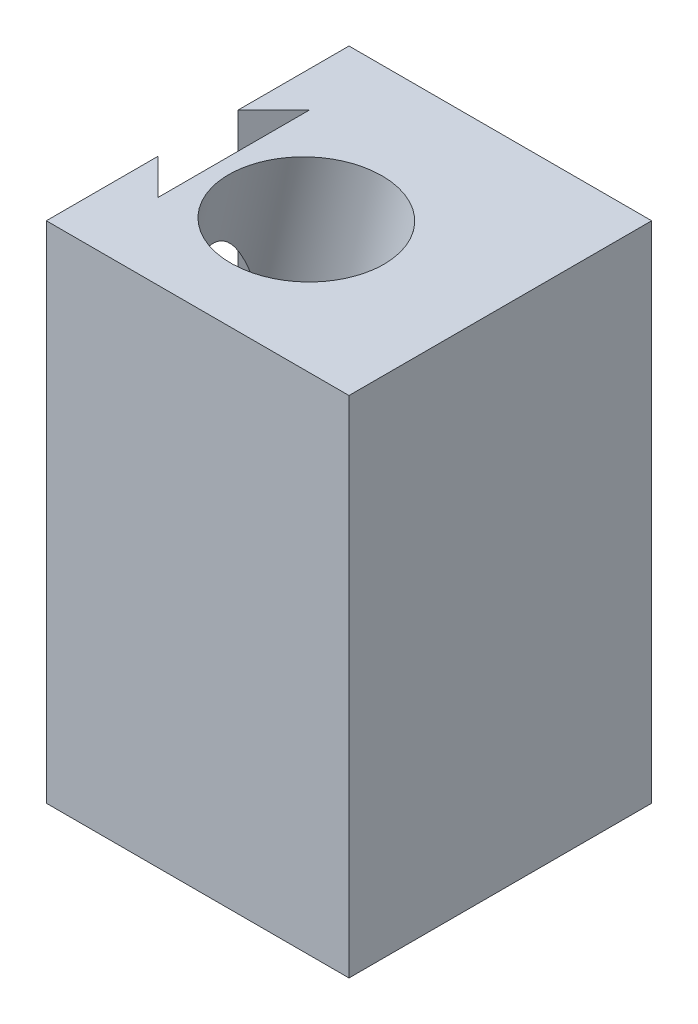
ISO-10303-21;
HEADER;
FILE_DESCRIPTION(('STEP AP214'),'2;1');
FILE_NAME('part.step','',(''),(''),'','','');
FILE_SCHEMA(('AUTOMOTIVE_DESIGN { 1 0 10303 214 1 1 1 1 }'));
ENDSEC;
DATA;
#1=APPLICATION_CONTEXT('core data for automotive mechanical design processes');
#2=APPLICATION_PROTOCOL_DEFINITION('international standard','automotive_design',2000,#1);
#3=PRODUCT_CONTEXT('',#1,'mechanical');
#4=PRODUCT('Part','Part','',(#3));
#5=PRODUCT_RELATED_PRODUCT_CATEGORY('part','',(#4));
#6=PRODUCT_DEFINITION_FORMATION('','',#4);
#7=PRODUCT_DEFINITION_CONTEXT('part definition',#1,'design');
#8=PRODUCT_DEFINITION('design','',#6,#7);
#9=PRODUCT_DEFINITION_SHAPE('','',#8);
#10=(LENGTH_UNIT() NAMED_UNIT(*) SI_UNIT(.MILLI.,.METRE.));
#11=(NAMED_UNIT(*) PLANE_ANGLE_UNIT() SI_UNIT($,.RADIAN.));
#12=(NAMED_UNIT(*) SI_UNIT($,.STERADIAN.) SOLID_ANGLE_UNIT());
#13=UNCERTAINTY_MEASURE_WITH_UNIT(LENGTH_MEASURE(1.E-05),#10,'distance_accuracy_value','');
#14=(GEOMETRIC_REPRESENTATION_CONTEXT(3) GLOBAL_UNCERTAINTY_ASSIGNED_CONTEXT((#13)) GLOBAL_UNIT_ASSIGNED_CONTEXT((#10,
#11,#12)) REPRESENTATION_CONTEXT('',''));
#15=CARTESIAN_POINT('',(0.,0.,0.));
#16=DIRECTION('',(0.,0.,1.));
#17=DIRECTION('',(1.,0.,0.));
#18=AXIS2_PLACEMENT_3D('',#15,#16,#17);
#19=CARTESIAN_POINT('',(3.53553390593274,50.,-22.5355339059327));
#20=DIRECTION('',(1.,0.,0.));
#21=DIRECTION('',(0.,0.,-1.));
#22=AXIS2_PLACEMENT_3D('',#19,#20,#21);
#23=PLANE('',#22);
#24=DIRECTION('',(0.,0.,1.));
#25=VECTOR('',#24,1.);
#26=CARTESIAN_POINT('',(3.53553390593274,25.3206801824394,-22.5355339059327));
#27=LINE('',#26,#25);
#28=CARTESIAN_POINT('',(3.53553390593274,25.3206801824394,-10.1088399375963));
#29=VERTEX_POINT('',#28);
#30=CARTESIAN_POINT('',(3.53553390593274,25.3206801824394,-7.53553390593274));
#31=VERTEX_POINT('',#30);
#32=EDGE_CURVE('E245',#29,#31,#27,.T.);
#33=ORIENTED_EDGE('',*,*,#32,.F.);
#34=CARTESIAN_POINT('',(3.53553390593274,9.99129665672789,-13.));
#35=DIRECTION('',(1.,0.,0.));
#36=DIRECTION('',(0.,1.,0.));
#37=AXIS2_PLACEMENT_3D('',#34,#35,#36);
#38=ELLIPSE('',#37,20.0043516716361,4.5);
#39=CARTESIAN_POINT('',(3.53553390593274,0.,-9.10147376776337));
#40=VERTEX_POINT('',#39);
#41=EDGE_CURVE('E62',#29,#40,#38,.T.);
#42=ORIENTED_EDGE('',*,*,#41,.T.);
#43=DIRECTION('',(0.,0.,1.));
#44=VECTOR('',#43,1.);
#45=CARTESIAN_POINT('',(3.53553390593274,0.,-22.5355339059327));
#46=LINE('',#45,#44);
#47=CARTESIAN_POINT('',(3.53553390593274,0.,-7.53553390593274));
#48=VERTEX_POINT('',#47);
#49=EDGE_CURVE('E249',#40,#48,#46,.T.);
#50=ORIENTED_EDGE('',*,*,#49,.T.);
#51=DIRECTION('',(0.,-1.,0.));
#52=VECTOR('',#51,1.);
#53=CARTESIAN_POINT('',(3.53553390593274,50.,-7.53553390593274));
#54=LINE('',#53,#52);
#55=EDGE_CURVE('E212',#31,#48,#54,.T.);
#56=ORIENTED_EDGE('',*,*,#55,.F.);
#57=EDGE_LOOP('',(#33,#42,#50,#56));
#58=FACE_BOUND('',#57,.T.);
#59=ADVANCED_FACE('F38',(#58),#23,.F.);
#60=CARTESIAN_POINT('',(3.53553390593274,50.,-7.53553390593274));
#61=DIRECTION('',(-0.707106781186548,0.,0.707106781186547));
#62=DIRECTION('',(0.707106781186547,0.,0.707106781186548));
#63=AXIS2_PLACEMENT_3D('',#60,#61,#62);
#64=PLANE('',#63);
#65=DIRECTION('',(-0.707106781186547,0.,-0.707106781186548));
#66=VECTOR('',#65,1.);
#67=CARTESIAN_POINT('',(3.53553390593274,0.,-7.53553390593274));
#68=LINE('',#67,#66);
#69=CARTESIAN_POINT('',(2.41906673964484,0.,-8.65200107222064));
#70=VERTEX_POINT('',#69);
#71=EDGE_CURVE('E162',#48,#70,#68,.T.);
#72=ORIENTED_EDGE('',*,*,#71,.T.);
#73=CARTESIAN_POINT('',(-1.92893218813452,-13.6779063955681,-13.));
#74=DIRECTION('',(-0.707106781186548,0.,0.707106781186547));
#75=DIRECTION('',(0.113926009599915,0.98693552407099,0.113926009599915));
#76=AXIS2_PLACEMENT_3D('',#73,#74,#75);
#77=ELLIPSE('',#76,28.2904254405086,4.5);
#78=CARTESIAN_POINT('',(0.,12.7505458677029,-11.0710678118655));
#79=VERTEX_POINT('',#78);
#80=EDGE_CURVE('E54',#70,#79,#77,.T.);
#81=ORIENTED_EDGE('',*,*,#80,.T.);
#82=DIRECTION('',(0.,-1.,0.));
#83=VECTOR('',#82,1.);
#84=CARTESIAN_POINT('',(0.,50.,-11.0710678118655));
#85=LINE('',#84,#83);
#86=CARTESIAN_POINT('',(0.,26.1369224999652,-11.0710678118655));
#87=VERTEX_POINT('',#86);
#88=EDGE_CURVE('E154',#87,#79,#85,.T.);
#89=ORIENTED_EDGE('',*,*,#88,.F.);
#90=DIRECTION('',(-0.697868801664496,0.161115707883247,-0.697868801664496));
#91=VECTOR('',#90,1.);
#92=CARTESIAN_POINT('',(0.760649774602985,25.9613126624225,-10.3104180372625));
#93=LINE('',#92,#91);
#94=EDGE_CURVE('E242',#31,#87,#93,.T.);
#95=ORIENTED_EDGE('',*,*,#94,.F.);
#96=ORIENTED_EDGE('',*,*,#55,.T.);
#97=EDGE_LOOP('',(#72,#81,#89,#95,#96));
#98=FACE_BOUND('',#97,.T.);
#99=ADVANCED_FACE('F290',(#98),#64,.F.);
#100=CARTESIAN_POINT('',(3.53553390593274,0.,-22.5355339059327));
#101=VERTEX_POINT('',#100);
#102=CARTESIAN_POINT('',(3.53553390593274,0.,-16.8985262322366));
#103=VERTEX_POINT('',#102);
#104=EDGE_CURVE('E168',#101,#103,#46,.T.);
#105=ORIENTED_EDGE('',*,*,#104,.T.);
#106=CARTESIAN_POINT('',(3.53553390593274,25.3206801824394,-15.8911600624037));
#107=VERTEX_POINT('',#106);
#108=EDGE_CURVE('E303',#103,#107,#38,.T.);
#109=ORIENTED_EDGE('',*,*,#108,.T.);
#110=CARTESIAN_POINT('',(3.53553390593274,25.3206801824394,-19.6602407243611));
#111=VERTEX_POINT('',#110);
#112=EDGE_CURVE('E246',#111,#107,#27,.T.);
#113=ORIENTED_EDGE('',*,*,#112,.F.);
#114=CARTESIAN_POINT('',(3.53553390593274,9.99129665672788,-13.));
#115=DIRECTION('',(1.,0.,0.));
#116=DIRECTION('',(0.,1.,0.));
#117=AXIS2_PLACEMENT_3D('',#114,#115,#116);
#118=ELLIPSE('',#117,33.3405861193934,7.5);
#119=CARTESIAN_POINT('',(3.53553390593274,32.8277394611723,-7.53553390593274));
#120=VERTEX_POINT('',#119);
#121=EDGE_CURVE('E238',#111,#120,#118,.T.);
#122=ORIENTED_EDGE('',*,*,#121,.T.);
#123=CARTESIAN_POINT('',(3.53553390593274,50.,-7.53553390593274));
#124=VERTEX_POINT('',#123);
#125=EDGE_CURVE('E47',#124,#120,#54,.T.);
#126=ORIENTED_EDGE('',*,*,#125,.F.);
#127=DIRECTION('',(0.,0.,1.));
#128=VECTOR('',#127,1.);
#129=CARTESIAN_POINT('',(3.53553390593274,50.,-22.5355339059327));
#130=LINE('',#129,#128);
#131=CARTESIAN_POINT('',(3.53553390593274,50.,-22.5355339059327));
#132=VERTEX_POINT('',#131);
#133=EDGE_CURVE('E187',#132,#124,#130,.T.);
#134=ORIENTED_EDGE('',*,*,#133,.F.);
#135=DIRECTION('',(0.,-1.,0.));
#136=VECTOR('',#135,1.);
#137=CARTESIAN_POINT('',(3.53553390593274,50.,-22.5355339059327));
#138=LINE('',#137,#136);
#139=EDGE_CURVE('E188',#132,#101,#138,.T.);
#140=ORIENTED_EDGE('',*,*,#139,.T.);
#141=EDGE_LOOP('',(#105,#109,#113,#122,#126,#134,#140));
#142=FACE_BOUND('',#141,.T.);
#143=ADVANCED_FACE('F40',(#142),#23,.F.);
#144=ORIENTED_EDGE('',*,*,#125,.T.);
#145=CARTESIAN_POINT('',(-1.92893218813452,-13.6779063955682,-13.));
#146=DIRECTION('',(-0.707106781186548,0.,0.707106781186547));
#147=DIRECTION('',(0.113926009599915,0.98693552407099,0.113926009599915));
#148=AXIS2_PLACEMENT_3D('',#145,#146,#147);
#149=ELLIPSE('',#148,47.1507090675143,7.5);
#150=CARTESIAN_POINT('',(0.,26.8962456760622,-11.0710678118655));
#151=VERTEX_POINT('',#150);
#152=EDGE_CURVE('E224',#120,#151,#149,.T.);
#153=ORIENTED_EDGE('',*,*,#152,.T.);
#154=CARTESIAN_POINT('',(0.,50.,-11.0710678118655));
#155=VERTEX_POINT('',#154);
#156=EDGE_CURVE('E208',#155,#151,#85,.T.);
#157=ORIENTED_EDGE('',*,*,#156,.F.);
#158=DIRECTION('',(-0.707106781186547,0.,-0.707106781186548));
#159=VECTOR('',#158,1.);
#160=CARTESIAN_POINT('',(3.53553390593274,50.,-7.53553390593274));
#161=LINE('',#160,#159);
#162=EDGE_CURVE('E253',#124,#155,#161,.T.);
#163=ORIENTED_EDGE('',*,*,#162,.F.);
#164=EDGE_LOOP('',(#144,#153,#157,#163));
#165=FACE_BOUND('',#164,.T.);
#166=ADVANCED_FACE('F299',(#165),#64,.F.);
#167=CARTESIAN_POINT('',(0.,50.,0.));
#168=DIRECTION('',(-1.,0.,0.));
#169=DIRECTION('',(0.,0.,1.));
#170=AXIS2_PLACEMENT_3D('',#167,#168,#169);
#171=PLANE('',#170);
#172=CARTESIAN_POINT('',(0.,-5.32278315953335,-13.));
#173=DIRECTION('',(-1.,0.,0.));
#174=DIRECTION('',(0.,1.,0.));
#175=AXIS2_PLACEMENT_3D('',#172,#173,#174);
#176=ELLIPSE('',#175,20.0043516716361,4.5);
#177=CARTESIAN_POINT('',(0.,0.,-8.6622222948491));
#178=VERTEX_POINT('',#177);
#179=EDGE_CURVE('E140',#178,#79,#176,.T.);
#180=ORIENTED_EDGE('',*,*,#179,.F.);
#181=DIRECTION('',(0.,0.,-1.));
#182=VECTOR('',#181,1.);
#183=CARTESIAN_POINT('',(0.,0.,0.));
#184=LINE('',#183,#182);
#185=CARTESIAN_POINT('',(0.,0.,0.));
#186=VERTEX_POINT('',#185);
#187=EDGE_CURVE('E152',#186,#178,#184,.T.);
#188=ORIENTED_EDGE('',*,*,#187,.F.);
#189=DIRECTION('',(0.,-1.,0.));
#190=VECTOR('',#189,1.);
#191=CARTESIAN_POINT('',(0.,50.,0.));
#192=LINE('',#191,#190);
#193=CARTESIAN_POINT('',(0.,50.,0.));
#194=VERTEX_POINT('',#193);
#195=EDGE_CURVE('E205',#194,#186,#192,.T.);
#196=ORIENTED_EDGE('',*,*,#195,.F.);
#197=DIRECTION('',(0.,0.,-1.));
#198=VECTOR('',#197,1.);
#199=CARTESIAN_POINT('',(0.,50.,0.));
#200=LINE('',#199,#198);
#201=EDGE_CURVE('E256',#194,#155,#200,.T.);
#202=ORIENTED_EDGE('',*,*,#201,.T.);
#203=ORIENTED_EDGE('',*,*,#156,.T.);
#204=CARTESIAN_POINT('',(0.,-5.32278315953336,-13.));
#205=DIRECTION('',(-1.,0.,0.));
#206=DIRECTION('',(0.,1.,0.));
#207=AXIS2_PLACEMENT_3D('',#204,#205,#206);
#208=ELLIPSE('',#207,33.3405861193934,7.5);
#209=CARTESIAN_POINT('',(0.,26.1369224999652,-10.5165403335304));
#210=VERTEX_POINT('',#209);
#211=EDGE_CURVE('E218',#210,#151,#208,.T.);
#212=ORIENTED_EDGE('',*,*,#211,.F.);
#213=DIRECTION('',(0.,0.,-1.));
#214=VECTOR('',#213,1.);
#215=CARTESIAN_POINT('',(0.,26.1369224999652,0.));
#216=LINE('',#215,#214);
#217=EDGE_CURVE('E11',#210,#87,#216,.T.);
#218=ORIENTED_EDGE('',*,*,#217,.T.);
#219=ORIENTED_EDGE('',*,*,#88,.T.);
#220=EDGE_LOOP('',(#180,#188,#196,#202,#203,#212,#218,#219));
#221=FACE_BOUND('',#220,.T.);
#222=ADVANCED_FACE('F151',(#221),#171,.T.);
#223=CARTESIAN_POINT('',(0.,50.,0.));
#224=DIRECTION('',(0.,0.,-1.));
#225=DIRECTION('',(-1.,0.,0.));
#226=AXIS2_PLACEMENT_3D('',#223,#224,#225);
#227=PLANE('',#226);
#228=DIRECTION('',(1.,0.,0.));
#229=VECTOR('',#228,1.);
#230=CARTESIAN_POINT('',(0.,0.,0.));
#231=LINE('',#230,#229);
#232=CARTESIAN_POINT('',(30.,0.,0.));
#233=VERTEX_POINT('',#232);
#234=EDGE_CURVE('E160',#186,#233,#231,.T.);
#235=ORIENTED_EDGE('',*,*,#234,.T.);
#236=DIRECTION('',(0.,-1.,0.));
#237=VECTOR('',#236,1.);
#238=CARTESIAN_POINT('',(30.,50.,0.));
#239=LINE('',#238,#237);
#240=CARTESIAN_POINT('',(30.,50.,0.));
#241=VERTEX_POINT('',#240);
#242=EDGE_CURVE('E201',#241,#233,#239,.T.);
#243=ORIENTED_EDGE('',*,*,#242,.F.);
#244=DIRECTION('',(1.,0.,0.));
#245=VECTOR('',#244,1.);
#246=CARTESIAN_POINT('',(0.,50.,0.));
#247=LINE('',#246,#245);
#248=EDGE_CURVE('E260',#194,#241,#247,.T.);
#249=ORIENTED_EDGE('',*,*,#248,.F.);
#250=ORIENTED_EDGE('',*,*,#195,.T.);
#251=EDGE_LOOP('',(#235,#243,#249,#250));
#252=FACE_BOUND('',#251,.T.);
#253=ADVANCED_FACE('F336',(#252),#227,.F.);
#254=CARTESIAN_POINT('',(30.,50.,0.));
#255=DIRECTION('',(-1.,0.,0.));
#256=DIRECTION('',(0.,0.,1.));
#257=AXIS2_PLACEMENT_3D('',#254,#255,#256);
#258=PLANE('',#257);
#259=DIRECTION('',(0.,0.,-1.));
#260=VECTOR('',#259,1.);
#261=CARTESIAN_POINT('',(30.,0.,0.));
#262=LINE('',#261,#260);
#263=CARTESIAN_POINT('',(30.,0.,-30.));
#264=VERTEX_POINT('',#263);
#265=EDGE_CURVE('E166',#233,#264,#262,.T.);
#266=ORIENTED_EDGE('',*,*,#265,.T.);
#267=DIRECTION('',(0.,-1.,0.));
#268=VECTOR('',#267,1.);
#269=CARTESIAN_POINT('',(30.,50.,-30.));
#270=LINE('',#269,#268);
#271=CARTESIAN_POINT('',(30.,50.,-30.));
#272=VERTEX_POINT('',#271);
#273=EDGE_CURVE('E198',#272,#264,#270,.T.);
#274=ORIENTED_EDGE('',*,*,#273,.F.);
#275=DIRECTION('',(0.,0.,-1.));
#276=VECTOR('',#275,1.);
#277=CARTESIAN_POINT('',(30.,50.,0.));
#278=LINE('',#277,#276);
#279=EDGE_CURVE('E263',#241,#272,#278,.T.);
#280=ORIENTED_EDGE('',*,*,#279,.F.);
#281=ORIENTED_EDGE('',*,*,#242,.T.);
#282=EDGE_LOOP('',(#266,#274,#280,#281));
#283=FACE_BOUND('',#282,.T.);
#284=ADVANCED_FACE('F341',(#283),#258,.F.);
#285=CARTESIAN_POINT('',(0.,50.,-30.));
#286=DIRECTION('',(0.,0.,-1.));
#287=DIRECTION('',(-1.,0.,0.));
#288=AXIS2_PLACEMENT_3D('',#285,#286,#287);
#289=PLANE('',#288);
#290=DIRECTION('',(1.,0.,0.));
#291=VECTOR('',#290,1.);
#292=CARTESIAN_POINT('',(0.,0.,-30.));
#293=LINE('',#292,#291);
#294=CARTESIAN_POINT('',(0.,0.,-30.));
#295=VERTEX_POINT('',#294);
#296=EDGE_CURVE('E175',#295,#264,#293,.T.);
#297=ORIENTED_EDGE('',*,*,#296,.F.);
#298=DIRECTION('',(0.,-1.,0.));
#299=VECTOR('',#298,1.);
#300=CARTESIAN_POINT('',(0.,50.,-30.));
#301=LINE('',#300,#299);
#302=CARTESIAN_POINT('',(0.,50.,-30.));
#303=VERTEX_POINT('',#302);
#304=EDGE_CURVE('E195',#303,#295,#301,.T.);
#305=ORIENTED_EDGE('',*,*,#304,.F.);
#306=DIRECTION('',(1.,0.,0.));
#307=VECTOR('',#306,1.);
#308=CARTESIAN_POINT('',(0.,50.,-30.));
#309=LINE('',#308,#307);
#310=EDGE_CURVE('E266',#303,#272,#309,.T.);
#311=ORIENTED_EDGE('',*,*,#310,.T.);
#312=ORIENTED_EDGE('',*,*,#273,.T.);
#313=EDGE_LOOP('',(#297,#305,#311,#312));
#314=FACE_BOUND('',#313,.T.);
#315=ADVANCED_FACE('F345',(#314),#289,.T.);
#316=CARTESIAN_POINT('',(0.,50.,-19.));
#317=DIRECTION('',(-1.,0.,0.));
#318=DIRECTION('',(0.,0.,1.));
#319=AXIS2_PLACEMENT_3D('',#316,#317,#318);
#320=PLANE('',#319);
#321=DIRECTION('',(0.,0.,-1.));
#322=VECTOR('',#321,1.);
#323=CARTESIAN_POINT('',(0.,0.,-19.));
#324=LINE('',#323,#322);
#325=CARTESIAN_POINT('',(0.,0.,-19.));
#326=VERTEX_POINT('',#325);
#327=EDGE_CURVE('E179',#326,#295,#324,.T.);
#328=ORIENTED_EDGE('',*,*,#327,.F.);
#329=DIRECTION('',(0.,-1.,0.));
#330=VECTOR('',#329,1.);
#331=CARTESIAN_POINT('',(0.,50.,-19.));
#332=LINE('',#331,#330);
#333=CARTESIAN_POINT('',(0.,50.,-19.));
#334=VERTEX_POINT('',#333);
#335=EDGE_CURVE('E191',#334,#326,#332,.T.);
#336=ORIENTED_EDGE('',*,*,#335,.F.);
#337=DIRECTION('',(0.,0.,-1.));
#338=VECTOR('',#337,1.);
#339=CARTESIAN_POINT('',(0.,50.,-19.));
#340=LINE('',#339,#338);
#341=EDGE_CURVE('E270',#334,#303,#340,.T.);
#342=ORIENTED_EDGE('',*,*,#341,.T.);
#343=ORIENTED_EDGE('',*,*,#304,.T.);
#344=EDGE_LOOP('',(#328,#336,#342,#343));
#345=FACE_BOUND('',#344,.T.);
#346=ADVANCED_FACE('F349',(#345),#320,.T.);
#347=CARTESIAN_POINT('',(3.53553390593274,50.,-22.5355339059327));
#348=DIRECTION('',(0.707106781186548,0.,0.707106781186547));
#349=DIRECTION('',(0.707106781186547,0.,-0.707106781186548));
#350=AXIS2_PLACEMENT_3D('',#347,#348,#349);
#351=PLANE('',#350);
#352=DIRECTION('',(-0.707106781186547,0.,0.707106781186548));
#353=VECTOR('',#352,1.);
#354=CARTESIAN_POINT('',(3.53553390593274,0.,-22.5355339059327));
#355=LINE('',#354,#353);
#356=EDGE_CURVE('E183',#101,#326,#355,.T.);
#357=ORIENTED_EDGE('',*,*,#356,.F.);
#358=ORIENTED_EDGE('',*,*,#139,.F.);
#359=DIRECTION('',(-0.707106781186547,0.,0.707106781186548));
#360=VECTOR('',#359,1.);
#361=CARTESIAN_POINT('',(3.53553390593274,50.,-22.5355339059327));
#362=LINE('',#361,#360);
#363=EDGE_CURVE('E192',#132,#334,#362,.T.);
#364=ORIENTED_EDGE('',*,*,#363,.T.);
#365=ORIENTED_EDGE('',*,*,#335,.T.);
#366=EDGE_LOOP('',(#357,#358,#364,#365));
#367=FACE_BOUND('',#366,.T.);
#368=ADVANCED_FACE('F353',(#367),#351,.T.);
#369=CARTESIAN_POINT('',(0.,50.,0.));
#370=DIRECTION('',(0.,1.,0.));
#371=DIRECTION('',(0.,0.,1.));
#372=AXIS2_PLACEMENT_3D('',#369,#370,#371);
#373=PLANE('',#372);
#374=CARTESIAN_POINT('',(12.7722708760733,50.,-13.));
#375=DIRECTION('',(0.,1.,0.));
#376=DIRECTION('',(1.,0.,0.));
#377=AXIS2_PLACEMENT_3D('',#374,#375,#376);
#378=ELLIPSE('',#377,7.69728080845044,7.5);
#379=CARTESIAN_POINT('',(20.4695516845237,50.,-13.));
#380=VERTEX_POINT('',#379);
#381=EDGE_CURVE('E215',#380,#380,#378,.T.);
#382=ORIENTED_EDGE('',*,*,#381,.F.);
#383=EDGE_LOOP('',(#382));
#384=FACE_BOUND('',#383,.T.);
#385=ORIENTED_EDGE('',*,*,#133,.T.);
#386=ORIENTED_EDGE('',*,*,#162,.T.);
#387=ORIENTED_EDGE('',*,*,#201,.F.);
#388=ORIENTED_EDGE('',*,*,#248,.T.);
#389=ORIENTED_EDGE('',*,*,#279,.T.);
#390=ORIENTED_EDGE('',*,*,#310,.F.);
#391=ORIENTED_EDGE('',*,*,#341,.F.);
#392=ORIENTED_EDGE('',*,*,#363,.F.);
#393=EDGE_LOOP('',(#385,#386,#387,#388,#389,#390,#391,#392));
#394=FACE_BOUND('',#393,.T.);
#395=ADVANCED_FACE('F357',(#384,#394),#373,.T.);
#396=CARTESIAN_POINT('',(0.,0.,0.));
#397=DIRECTION('',(0.,1.,0.));
#398=DIRECTION('',(0.,0.,1.));
#399=AXIS2_PLACEMENT_3D('',#396,#397,#398);
#400=PLANE('',#399);
#401=ORIENTED_EDGE('',*,*,#187,.T.);
#402=CARTESIAN_POINT('',(1.22886131979508,0.,-13.));
#403=DIRECTION('',(0.,1.,0.));
#404=DIRECTION('',(1.,0.,0.));
#405=AXIS2_PLACEMENT_3D('',#402,#403,#404);
#406=ELLIPSE('',#405,4.61836848507026,4.5);
#407=EDGE_CURVE('E137',#178,#70,#406,.T.);
#408=ORIENTED_EDGE('',*,*,#407,.T.);
#409=ORIENTED_EDGE('',*,*,#71,.F.);
#410=ORIENTED_EDGE('',*,*,#49,.F.);
#411=EDGE_CURVE('E147',#40,#103,#406,.T.);
#412=ORIENTED_EDGE('',*,*,#411,.T.);
#413=ORIENTED_EDGE('',*,*,#104,.F.);
#414=ORIENTED_EDGE('',*,*,#356,.T.);
#415=ORIENTED_EDGE('',*,*,#327,.T.);
#416=ORIENTED_EDGE('',*,*,#296,.T.);
#417=ORIENTED_EDGE('',*,*,#265,.F.);
#418=ORIENTED_EDGE('',*,*,#234,.F.);
#419=EDGE_LOOP('',(#401,#408,#409,#410,#412,#413,#414,#415,#416,#417,#418));
#420=FACE_BOUND('',#419,.T.);
#421=ADVANCED_FACE('F158',(#420),#400,.F.);
#422=CARTESIAN_POINT('',(6.89551362380061,24.5449677427566,-13.));
#423=DIRECTION('',(0.224951054343866,0.974370064785235,0.));
#424=DIRECTION('',(-0.974370064785235,0.224951054343866,0.));
#425=AXIS2_PLACEMENT_3D('',#422,#423,#424);
#426=PLANE('',#425);
#427=CARTESIAN_POINT('',(6.89551362380061,24.5449677427566,-13.));
#428=DIRECTION('',(0.224951054343866,0.974370064785235,0.));
#429=DIRECTION('',(-0.974370064785235,0.224951054343866,0.));
#430=AXIS2_PLACEMENT_3D('',#427,#428,#429);
#431=CIRCLE('',#430,4.5);
#432=EDGE_CURVE('E304',#29,#107,#431,.T.);
#433=ORIENTED_EDGE('',*,*,#432,.F.);
#434=ORIENTED_EDGE('',*,*,#32,.T.);
#435=ORIENTED_EDGE('',*,*,#94,.T.);
#436=ORIENTED_EDGE('',*,*,#217,.F.);
#437=CARTESIAN_POINT('',(6.89551362380061,24.5449677427566,-13.));
#438=DIRECTION('',(0.224951054343866,0.974370064785235,0.));
#439=DIRECTION('',(-0.974370064785235,0.224951054343866,0.));
#440=AXIS2_PLACEMENT_3D('',#437,#438,#439);
#441=CIRCLE('',#440,7.5);
#442=EDGE_CURVE('E219',#210,#111,#441,.T.);
#443=ORIENTED_EDGE('',*,*,#442,.T.);
#444=ORIENTED_EDGE('',*,*,#112,.T.);
#445=EDGE_LOOP('',(#433,#434,#435,#436,#443,#444));
#446=FACE_BOUND('',#445,.T.);
#447=ADVANCED_FACE('F293',(#446),#426,.T.);
#448=CARTESIAN_POINT('',(6.89551362380061,24.5449677427566,-13.));
#449=DIRECTION('',(0.224951054343865,0.974370064785235,0.));
#450=DIRECTION('',(-0.974370064785235,0.224951054343866,0.));
#451=AXIS2_PLACEMENT_3D('',#448,#449,#450);
#452=CYLINDRICAL_SURFACE('',#451,7.5);
#453=ORIENTED_EDGE('',*,*,#381,.T.);
#454=EDGE_LOOP('',(#453));
#455=FACE_BOUND('',#454,.T.);
#456=ORIENTED_EDGE('',*,*,#442,.F.);
#457=ORIENTED_EDGE('',*,*,#211,.T.);
#458=ORIENTED_EDGE('',*,*,#152,.F.);
#459=ORIENTED_EDGE('',*,*,#121,.F.);
#460=EDGE_LOOP('',(#456,#457,#458,#459));
#461=FACE_BOUND('',#460,.T.);
#462=ADVANCED_FACE('F297',(#455,#461),#452,.F.);
#463=CARTESIAN_POINT('',(1.16667727887712,-0.269348673001654,-13.));
#464=DIRECTION('',(0.224951054343866,0.974370064785235,0.));
#465=DIRECTION('',(-0.974370064785235,0.224951054343866,0.));
#466=AXIS2_PLACEMENT_3D('',#463,#464,#465);
#467=CYLINDRICAL_SURFACE('',#466,4.5);
#468=ORIENTED_EDGE('',*,*,#432,.T.);
#469=ORIENTED_EDGE('',*,*,#108,.F.);
#470=ORIENTED_EDGE('',*,*,#411,.F.);
#471=ORIENTED_EDGE('',*,*,#41,.F.);
#472=EDGE_LOOP('',(#468,#469,#470,#471));
#473=FACE_BOUND('',#472,.T.);
#474=ADVANCED_FACE('F313',(#473),#467,.F.);
#475=ORIENTED_EDGE('',*,*,#407,.F.);
#476=ORIENTED_EDGE('',*,*,#179,.T.);
#477=ORIENTED_EDGE('',*,*,#80,.F.);
#478=EDGE_LOOP('',(#475,#476,#477));
#479=FACE_BOUND('',#478,.T.);
#480=ADVANCED_FACE('F139',(#479),#467,.F.);
#481=CLOSED_SHELL('',(#59,#99,#143,#166,#222,#253,#284,#315,#346,#368,#395,#421,#447,#462,#474,#480));
#482=MANIFOLD_SOLID_BREP('B2',#481);
#483=ADVANCED_BREP_SHAPE_REPRESENTATION('',(#18,#482),#14);
#484=SHAPE_DEFINITION_REPRESENTATION(#9,#483);
ENDSEC;
END-ISO-10303-21;
